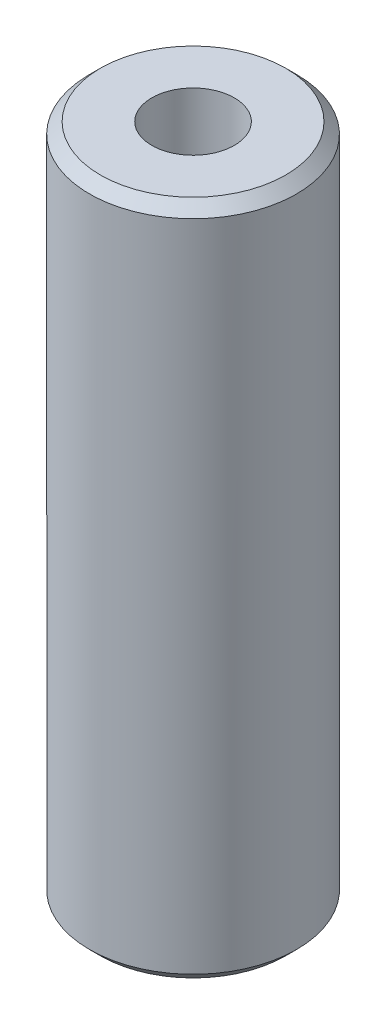
ISO-10303-21;
HEADER;
FILE_DESCRIPTION(('STEP AP214'),'2;1');
FILE_NAME('part.step','',(''),(''),'','','');
FILE_SCHEMA(('AUTOMOTIVE_DESIGN { 1 0 10303 214 1 1 1 1 }'));
ENDSEC;
DATA;
#1=APPLICATION_CONTEXT('core data for automotive mechanical design processes');
#2=APPLICATION_PROTOCOL_DEFINITION('international standard','automotive_design',2000,#1);
#3=PRODUCT_CONTEXT('',#1,'mechanical');
#4=PRODUCT('Part','Part','',(#3));
#5=PRODUCT_RELATED_PRODUCT_CATEGORY('part','',(#4));
#6=PRODUCT_DEFINITION_FORMATION('','',#4);
#7=PRODUCT_DEFINITION_CONTEXT('part definition',#1,'design');
#8=PRODUCT_DEFINITION('design','',#6,#7);
#9=PRODUCT_DEFINITION_SHAPE('','',#8);
#10=(LENGTH_UNIT() NAMED_UNIT(*) SI_UNIT(.MILLI.,.METRE.));
#11=(NAMED_UNIT(*) PLANE_ANGLE_UNIT() SI_UNIT($,.RADIAN.));
#12=(NAMED_UNIT(*) SI_UNIT($,.STERADIAN.) SOLID_ANGLE_UNIT());
#13=UNCERTAINTY_MEASURE_WITH_UNIT(LENGTH_MEASURE(1.E-05),#10,'distance_accuracy_value','');
#14=(GEOMETRIC_REPRESENTATION_CONTEXT(3) GLOBAL_UNCERTAINTY_ASSIGNED_CONTEXT((#13)) GLOBAL_UNIT_ASSIGNED_CONTEXT((#10,
#11,#12)) REPRESENTATION_CONTEXT('',''));
#15=CARTESIAN_POINT('',(0.,0.,0.));
#16=DIRECTION('',(0.,0.,1.));
#17=DIRECTION('',(1.,0.,0.));
#18=AXIS2_PLACEMENT_3D('',#15,#16,#17);
#19=CARTESIAN_POINT('',(0.,81.6411608012523,0.));
#20=DIRECTION('',(0.,-1.,0.));
#21=DIRECTION('',(0.,0.,-1.));
#22=AXIS2_PLACEMENT_3D('',#19,#20,#21);
#23=CYLINDRICAL_SURFACE('',#22,12.5);
#24=CARTESIAN_POINT('',(0.,80.3231756242813,0.));
#25=DIRECTION('',(0.,1.,0.));
#26=DIRECTION('',(0.,0.,1.));
#27=AXIS2_PLACEMENT_3D('',#24,#25,#26);
#28=CIRCLE('',#27,12.5);
#29=CARTESIAN_POINT('',(0.,80.3231756242813,-12.5));
#30=VERTEX_POINT('',#29);
#31=EDGE_CURVE('E50',#30,#30,#28,.F.);
#32=CARTESIAN_POINT('',(0.,1.31798517697104,0.));
#33=DIRECTION('',(0.,1.,0.));
#34=DIRECTION('',(0.,0.,1.));
#35=AXIS2_PLACEMENT_3D('',#32,#33,#34);
#36=CIRCLE('',#35,12.5);
#37=CARTESIAN_POINT('',(0.,1.31798517697104,-12.5));
#38=VERTEX_POINT('',#37);
#39=EDGE_CURVE('E51',#38,#38,#36,.T.);
#40=CARTESIAN_POINT('',(0.,80.3231756242813,-12.5));
#41=CARTESIAN_POINT('',(0.,79.5002048904552,-12.5));
#42=CARTESIAN_POINT('',(0.,78.677234156629,-12.5));
#43=CARTESIAN_POINT('',(0.,77.0312926889767,-12.5));
#44=CARTESIAN_POINT('',(0.,76.2083219551506,-12.5));
#45=CARTESIAN_POINT('',(0.,74.5623804874983,-12.5));
#46=CARTESIAN_POINT('',(0.,73.7394097536721,-12.5));
#47=CARTESIAN_POINT('',(0.,72.0934682860199,-12.5));
#48=CARTESIAN_POINT('',(0.,71.2704975521937,-12.5));
#49=CARTESIAN_POINT('',(0.,69.6245560845414,-12.5));
#50=CARTESIAN_POINT('',(0.,68.8015853507152,-12.5));
#51=CARTESIAN_POINT('',(0.,67.155643883063,-12.5));
#52=CARTESIAN_POINT('',(0.,66.3326731492368,-12.5));
#53=CARTESIAN_POINT('',(0.,64.6867316815845,-12.5));
#54=CARTESIAN_POINT('',(0.,63.8637609477584,-12.5));
#55=CARTESIAN_POINT('',(0.,62.2178194801061,-12.5));
#56=CARTESIAN_POINT('',(0.,61.3948487462799,-12.5));
#57=CARTESIAN_POINT('',(0.,59.7489072786276,-12.5));
#58=CARTESIAN_POINT('',(0.,58.9259365448015,-12.5));
#59=CARTESIAN_POINT('',(0.,57.2799950771492,-12.5));
#60=CARTESIAN_POINT('',(0.,56.457024343323,-12.5));
#61=CARTESIAN_POINT('',(0.,54.8110828756707,-12.5));
#62=CARTESIAN_POINT('',(0.,53.9881121418446,-12.5));
#63=CARTESIAN_POINT('',(0.,52.3421706741923,-12.5));
#64=CARTESIAN_POINT('',(0.,51.5191999403661,-12.5));
#65=CARTESIAN_POINT('',(0.,49.8732584727138,-12.5));
#66=CARTESIAN_POINT('',(0.,49.0502877388877,-12.5));
#67=CARTESIAN_POINT('',(0.,47.4043462712354,-12.5));
#68=CARTESIAN_POINT('',(0.,46.5813755374092,-12.5));
#69=CARTESIAN_POINT('',(0.,44.9354340697569,-12.5));
#70=CARTESIAN_POINT('',(0.,44.1124633359308,-12.5));
#71=CARTESIAN_POINT('',(0.,42.4665218682785,-12.5));
#72=CARTESIAN_POINT('',(0.,41.6435511344523,-12.5));
#73=CARTESIAN_POINT('',(0.,39.9976096668,-12.5));
#74=CARTESIAN_POINT('',(0.,39.1746389329739,-12.5));
#75=CARTESIAN_POINT('',(0.,37.5286974653216,-12.5));
#76=CARTESIAN_POINT('',(0.,36.7057267314954,-12.5));
#77=CARTESIAN_POINT('',(0.,35.0597852638432,-12.5));
#78=CARTESIAN_POINT('',(0.,34.236814530017,-12.5));
#79=CARTESIAN_POINT('',(0.,32.5908730623647,-12.5));
#80=CARTESIAN_POINT('',(0.,31.7679023285386,-12.5));
#81=CARTESIAN_POINT('',(0.,30.1219608608863,-12.5));
#82=CARTESIAN_POINT('',(0.,29.2989901270601,-12.5));
#83=CARTESIAN_POINT('',(0.,27.6530486594078,-12.5));
#84=CARTESIAN_POINT('',(0.,26.8300779255817,-12.5));
#85=CARTESIAN_POINT('',(0.,25.1841364579294,-12.5));
#86=CARTESIAN_POINT('',(0.,24.3611657241032,-12.5));
#87=CARTESIAN_POINT('',(0.,22.7152242564509,-12.5));
#88=CARTESIAN_POINT('',(0.,21.8922535226248,-12.5));
#89=CARTESIAN_POINT('',(0.,20.2463120549725,-12.5));
#90=CARTESIAN_POINT('',(0.,19.4233413211463,-12.5));
#91=CARTESIAN_POINT('',(0.,17.777399853494,-12.5));
#92=CARTESIAN_POINT('',(0.,16.9544291196679,-12.5));
#93=CARTESIAN_POINT('',(0.,15.3084876520156,-12.5));
#94=CARTESIAN_POINT('',(0.,14.4855169181894,-12.5));
#95=CARTESIAN_POINT('',(0.,12.8395754505371,-12.5));
#96=CARTESIAN_POINT('',(0.,12.016604716711,-12.5));
#97=CARTESIAN_POINT('',(0.,10.3706632490587,-12.5));
#98=CARTESIAN_POINT('',(0.,9.54769251523254,-12.5));
#99=CARTESIAN_POINT('',(0.,7.90175104758024,-12.5));
#100=CARTESIAN_POINT('',(0.,7.07878031375409,-12.5));
#101=CARTESIAN_POINT('',(0.,5.43283884610179,-12.5));
#102=CARTESIAN_POINT('',(0.,4.60986811227564,-12.5));
#103=CARTESIAN_POINT('',(0.,2.96392664462334,-12.5));
#104=CARTESIAN_POINT('',(0.,2.14095591079719,-12.5));
#105=CARTESIAN_POINT('',(0.,1.31798517697104,-12.5));
#106=B_SPLINE_CURVE_WITH_KNOTS('',3,(#40,#41,#42,#43,#44,#45,#46,#47,#48,#49,#50,#51,#52,#53,
#54,#55,#56,#57,#58,#59,#60,#61,#62,#63,#64,#65,#66,#67,#68,#69,#70,#71,#72,#73,#74,#75,#76,#77,
#78,#79,#80,#81,#82,#83,#84,#85,#86,#87,#88,#89,#90,#91,#92,#93,#94,#95,#96,#97,#98,#99,#100,
#101,#102,#103,#104,#105),.UNSPECIFIED.,.F.,.F.,(4,2,2,2,2,2,2,2,2,2,2,2,2,2,2,2,2,2,2,2,2,2,2,
2,2,2,2,2,2,2,2,2,4),(0.,2.46891220147843,4.93782440295688,7.40673660443533,9.87564880591378,
12.3445610073922,14.8134732088707,17.2823854103491,19.7512976118276,22.220209813306,
24.6891220147845,27.1580342162629,29.6269464177414,32.0958586192198,34.5647708206982,
37.0336830221767,39.5025952236551,41.9715074251336,44.440419626612,46.9093318280905,
49.3782440295689,51.8471562310474,54.3160684325258,56.7849806340043,59.2538928354827,
61.7228050369612,64.1917172384396,66.6606294399181,69.1295416413965,71.5984538428749,
74.0673660443534,76.5362782458318,79.0051904473103),.UNSPECIFIED.);
#107=EDGE_CURVE('BSEAM39',#30,#38,#106,.T.);
#108=ORIENTED_EDGE('',*,*,#31,.T.);
#109=ORIENTED_EDGE('',*,*,#39,.T.);
#110=ORIENTED_EDGE('',*,*,#107,.T.);
#111=ORIENTED_EDGE('',*,*,#107,.F.);
#112=EDGE_LOOP('',(#108,#110,#109,#111));
#113=FACE_BOUND('',#112,.T.);
#114=ADVANCED_FACE('F39',(#113),#23,.T.);
#115=CARTESIAN_POINT('',(0.,81.6411608012523,0.));
#116=DIRECTION('',(0.,1.,0.));
#117=DIRECTION('',(0.,0.,1.));
#118=AXIS2_PLACEMENT_3D('',#115,#116,#117);
#119=PLANE('',#118);
#120=CARTESIAN_POINT('',(0.,81.6411608012523,0.));
#121=DIRECTION('',(0.,1.,0.));
#122=DIRECTION('',(0.,0.,1.));
#123=AXIS2_PLACEMENT_3D('',#120,#121,#122);
#124=CIRCLE('',#123,11.1820148230291);
#125=CARTESIAN_POINT('',(0.,81.6411608012523,11.1820148230291));
#126=VERTEX_POINT('',#125);
#127=EDGE_CURVE('E54',#126,#126,#124,.T.);
#128=ORIENTED_EDGE('',*,*,#127,.T.);
#129=EDGE_LOOP('',(#128));
#130=FACE_BOUND('',#129,.T.);
#131=CARTESIAN_POINT('',(0.,81.6411608012523,0.));
#132=DIRECTION('',(0.,1.,0.));
#133=DIRECTION('',(0.,0.,1.));
#134=AXIS2_PLACEMENT_3D('',#131,#132,#133);
#135=CIRCLE('',#134,4.98116178115961);
#136=CARTESIAN_POINT('',(0.,81.6411608012523,-4.98116178115961));
#137=VERTEX_POINT('',#136);
#138=EDGE_CURVE('E58',#137,#137,#135,.T.);
#139=ORIENTED_EDGE('',*,*,#138,.F.);
#140=EDGE_LOOP('',(#139));
#141=FACE_BOUND('',#140,.T.);
#142=ADVANCED_FACE('F69',(#130,#141),#119,.T.);
#143=CARTESIAN_POINT('',(0.,0.,0.));
#144=DIRECTION('',(0.,1.,0.));
#145=DIRECTION('',(0.,0.,1.));
#146=AXIS2_PLACEMENT_3D('',#143,#144,#145);
#147=PLANE('',#146);
#148=CARTESIAN_POINT('',(0.,0.,0.));
#149=DIRECTION('',(0.,1.,0.));
#150=DIRECTION('',(0.,0.,1.));
#151=AXIS2_PLACEMENT_3D('',#148,#149,#150);
#152=CIRCLE('',#151,11.182014823029);
#153=CARTESIAN_POINT('',(0.,0.,11.182014823029));
#154=VERTEX_POINT('',#153);
#155=EDGE_CURVE('E10',#154,#154,#152,.F.);
#156=ORIENTED_EDGE('',*,*,#155,.T.);
#157=EDGE_LOOP('',(#156));
#158=FACE_BOUND('',#157,.T.);
#159=CARTESIAN_POINT('',(0.,0.,0.));
#160=DIRECTION('',(0.,1.,0.));
#161=DIRECTION('',(0.,0.,1.));
#162=AXIS2_PLACEMENT_3D('',#159,#160,#161);
#163=CIRCLE('',#162,4.98116178115961);
#164=CARTESIAN_POINT('',(0.,0.,-4.98116178115961));
#165=VERTEX_POINT('',#164);
#166=EDGE_CURVE('E63',#165,#165,#163,.T.);
#167=ORIENTED_EDGE('',*,*,#166,.T.);
#168=EDGE_LOOP('',(#167));
#169=FACE_BOUND('',#168,.T.);
#170=ADVANCED_FACE('F75',(#158,#169),#147,.F.);
#171=CARTESIAN_POINT('',(0.,81.6411608012523,0.));
#172=DIRECTION('',(0.,-1.,0.));
#173=DIRECTION('',(0.,0.,-1.));
#174=AXIS2_PLACEMENT_3D('',#171,#172,#173);
#175=CYLINDRICAL_SURFACE('',#174,4.98116178115961);
#176=CARTESIAN_POINT('',(0.,81.6411608012523,-4.98116178115961));
#177=CARTESIAN_POINT('',(0.,80.7907320429059,-4.98116178115961));
#178=CARTESIAN_POINT('',(0.,79.9403032845595,-4.98116178115961));
#179=CARTESIAN_POINT('',(0.,78.2394457678668,-4.98116178115961));
#180=CARTESIAN_POINT('',(0.,77.3890170095204,-4.98116178115961));
#181=CARTESIAN_POINT('',(0.,75.6881594928277,-4.98116178115961));
#182=CARTESIAN_POINT('',(0.,74.8377307344813,-4.98116178115961));
#183=CARTESIAN_POINT('',(0.,73.1368732177885,-4.98116178115961));
#184=CARTESIAN_POINT('',(0.,72.2864444594421,-4.98116178115961));
#185=CARTESIAN_POINT('',(0.,70.5855869427494,-4.98116178115961));
#186=CARTESIAN_POINT('',(0.,69.735158184403,-4.98116178115961));
#187=CARTESIAN_POINT('',(0.,68.0343006677102,-4.98116178115961));
#188=CARTESIAN_POINT('',(0.,67.1838719093639,-4.98116178115961));
#189=CARTESIAN_POINT('',(0.,65.4830143926711,-4.98116178115961));
#190=CARTESIAN_POINT('',(0.,64.6325856343247,-4.98116178115961));
#191=CARTESIAN_POINT('',(0.,62.931728117632,-4.98116178115961));
#192=CARTESIAN_POINT('',(0.,62.0812993592856,-4.98116178115961));
#193=CARTESIAN_POINT('',(0.,60.3804418425928,-4.98116178115961));
#194=CARTESIAN_POINT('',(0.,59.5300130842465,-4.98116178115961));
#195=CARTESIAN_POINT('',(0.,57.8291555675537,-4.98116178115961));
#196=CARTESIAN_POINT('',(0.,56.9787268092073,-4.98116178115961));
#197=CARTESIAN_POINT('',(0.,55.2778692925146,-4.98116178115961));
#198=CARTESIAN_POINT('',(0.,54.4274405341682,-4.98116178115961));
#199=CARTESIAN_POINT('',(0.,52.7265830174754,-4.98116178115961));
#200=CARTESIAN_POINT('',(0.,51.8761542591291,-4.98116178115961));
#201=CARTESIAN_POINT('',(0.,50.1752967424363,-4.98116178115961));
#202=CARTESIAN_POINT('',(0.,49.3248679840899,-4.98116178115961));
#203=CARTESIAN_POINT('',(0.,47.6240104673972,-4.98116178115961));
#204=CARTESIAN_POINT('',(0.,46.7735817090508,-4.98116178115961));
#205=CARTESIAN_POINT('',(0.,45.072724192358,-4.98116178115961));
#206=CARTESIAN_POINT('',(0.,44.2222954340117,-4.98116178115961));
#207=CARTESIAN_POINT('',(0.,42.5214379173189,-4.98116178115961));
#208=CARTESIAN_POINT('',(0.,41.6710091589725,-4.98116178115961));
#209=CARTESIAN_POINT('',(0.,39.9701516422798,-4.98116178115961));
#210=CARTESIAN_POINT('',(0.,39.1197228839334,-4.98116178115961));
#211=CARTESIAN_POINT('',(0.,37.4188653672406,-4.98116178115961));
#212=CARTESIAN_POINT('',(0.,36.5684366088943,-4.98116178115961));
#213=CARTESIAN_POINT('',(0.,34.8675790922015,-4.98116178115961));
#214=CARTESIAN_POINT('',(0.,34.0171503338551,-4.98116178115961));
#215=CARTESIAN_POINT('',(0.,32.3162928171624,-4.98116178115961));
#216=CARTESIAN_POINT('',(0.,31.465864058816,-4.98116178115961));
#217=CARTESIAN_POINT('',(0.,29.7650065421232,-4.98116178115961));
#218=CARTESIAN_POINT('',(0.,28.9145777837769,-4.98116178115961));
#219=CARTESIAN_POINT('',(0.,27.2137202670841,-4.98116178115961));
#220=CARTESIAN_POINT('',(0.,26.3632915087377,-4.98116178115961));
#221=CARTESIAN_POINT('',(0.,24.662433992045,-4.98116178115961));
#222=CARTESIAN_POINT('',(0.,23.8120052336986,-4.98116178115961));
#223=CARTESIAN_POINT('',(0.,22.1111477170058,-4.98116178115961));
#224=CARTESIAN_POINT('',(0.,21.2607189586594,-4.98116178115961));
#225=CARTESIAN_POINT('',(0.,19.5598614419667,-4.98116178115961));
#226=CARTESIAN_POINT('',(0.,18.7094326836203,-4.98116178115961));
#227=CARTESIAN_POINT('',(0.,17.0085751669276,-4.98116178115961));
#228=CARTESIAN_POINT('',(0.,16.1581464085812,-4.98116178115961));
#229=CARTESIAN_POINT('',(0.,14.4572888918884,-4.98116178115961));
#230=CARTESIAN_POINT('',(0.,13.606860133542,-4.98116178115961));
#231=CARTESIAN_POINT('',(0.,11.9060026168493,-4.98116178115961));
#232=CARTESIAN_POINT('',(0.,11.0555738585029,-4.98116178115961));
#233=CARTESIAN_POINT('',(0.,9.35471634181016,-4.98116178115961));
#234=CARTESIAN_POINT('',(0.,8.50428758346378,-4.98116178115961));
#235=CARTESIAN_POINT('',(0.,6.80343006677103,-4.98116178115961));
#236=CARTESIAN_POINT('',(0.,5.95300130842465,-4.98116178115961));
#237=CARTESIAN_POINT('',(0.,4.25214379173189,-4.98116178115961));
#238=CARTESIAN_POINT('',(0.,3.40171503338551,-4.98116178115961));
#239=CARTESIAN_POINT('',(0.,1.70085751669275,-4.98116178115961));
#240=CARTESIAN_POINT('',(0.,0.850428758346377,-4.98116178115961));
#241=CARTESIAN_POINT('',(0.,0.,-4.98116178115961));
#242=B_SPLINE_CURVE_WITH_KNOTS('',3,(#176,#177,#178,#179,#180,#181,#182,#183,#184,#185,#186,
#187,#188,#189,#190,#191,#192,#193,#194,#195,#196,#197,#198,#199,#200,#201,#202,#203,#204,#205,
#206,#207,#208,#209,#210,#211,#212,#213,#214,#215,#216,#217,#218,#219,#220,#221,#222,#223,#224,
#225,#226,#227,#228,#229,#230,#231,#232,#233,#234,#235,#236,#237,#238,#239,#240,#241),
.UNSPECIFIED.,.F.,.F.,(4,2,2,2,2,2,2,2,2,2,2,2,2,2,2,2,2,2,2,2,2,2,2,2,2,2,2,2,2,2,2,2,4),(0.,
2.55128627503913,5.10257255007826,7.65385882511739,10.2051451001565,12.7564313751957,
15.3077176502348,17.8590039252739,20.4102902003131,22.9615764753522,25.5128627503913,
28.0641490254305,30.6154353004696,33.1667215755087,35.7180078505479,38.269294125587,
40.8205804006261,43.3718666756653,45.9231529507044,48.4744392257435,51.0257255007827,
53.5770117758218,56.1282980508609,58.6795843259001,61.2308706009392,63.7821568759783,
66.3334431510175,68.8847294260566,71.4360157010957,73.9873019761349,76.538588251174,
79.0898745262132,81.6411608012523),.UNSPECIFIED.);
#243=EDGE_CURVE('BSEAM70',#137,#165,#242,.T.);
#244=ORIENTED_EDGE('',*,*,#138,.T.);
#245=ORIENTED_EDGE('',*,*,#166,.F.);
#246=ORIENTED_EDGE('',*,*,#243,.T.);
#247=ORIENTED_EDGE('',*,*,#243,.F.);
#248=EDGE_LOOP('',(#244,#246,#245,#247));
#249=FACE_BOUND('',#248,.T.);
#250=ADVANCED_FACE('F70',(#249),#175,.F.);
#251=CARTESIAN_POINT('',(0.,81.6411608012523,0.));
#252=DIRECTION('',(0.,-1.,0.));
#253=DIRECTION('',(0.,0.,-1.));
#254=AXIS2_PLACEMENT_3D('',#251,#252,#253);
#255=CONICAL_SURFACE('',#254,11.1820148230291,0.785398163397445);
#256=ORIENTED_EDGE('',*,*,#31,.F.);
#257=EDGE_LOOP('',(#256));
#258=FACE_BOUND('',#257,.T.);
#259=ORIENTED_EDGE('',*,*,#127,.F.);
#260=EDGE_LOOP('',(#259));
#261=FACE_BOUND('',#260,.T.);
#262=ADVANCED_FACE('F81',(#258,#261),#255,.T.);
#263=CARTESIAN_POINT('',(0.,1.31798517697104,0.));
#264=DIRECTION('',(0.,1.,0.));
#265=DIRECTION('',(0.,0.,1.));
#266=AXIS2_PLACEMENT_3D('',#263,#264,#265);
#267=CONICAL_SURFACE('',#266,12.5,0.785398163397448);
#268=ORIENTED_EDGE('',*,*,#155,.F.);
#269=EDGE_LOOP('',(#268));
#270=FACE_BOUND('',#269,.T.);
#271=ORIENTED_EDGE('',*,*,#39,.F.);
#272=EDGE_LOOP('',(#271));
#273=FACE_BOUND('',#272,.T.);
#274=ADVANCED_FACE('F45',(#270,#273),#267,.T.);
#275=CLOSED_SHELL('',(#114,#142,#170,#250,#262,#274));
#276=MANIFOLD_SOLID_BREP('B2',#275);
#277=ADVANCED_BREP_SHAPE_REPRESENTATION('',(#18,#276),#14);
#278=SHAPE_DEFINITION_REPRESENTATION(#9,#277);
ENDSEC;
END-ISO-10303-21;
